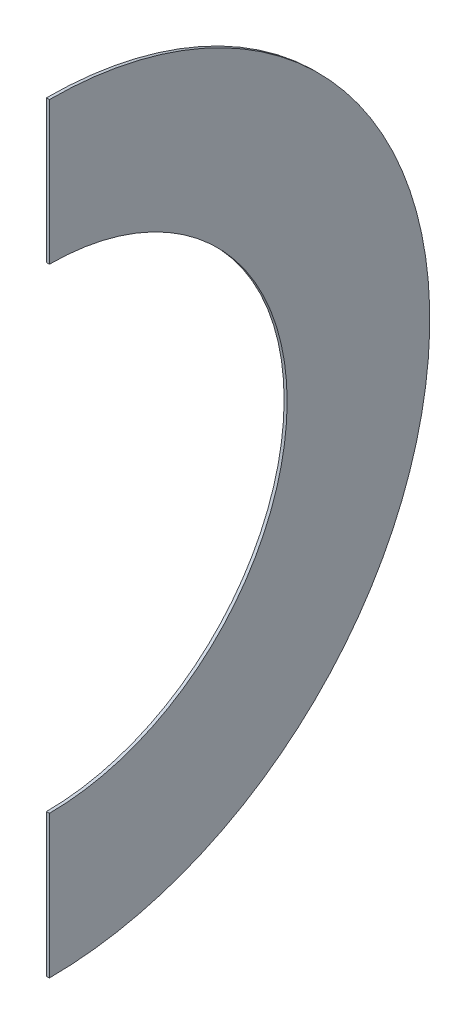
ISO-10303-21;
HEADER;
FILE_DESCRIPTION(('STEP AP214'),'2;1');
FILE_NAME('part.step','',(''),(''),'','','');
FILE_SCHEMA(('AUTOMOTIVE_DESIGN { 1 0 10303 214 1 1 1 1 }'));
ENDSEC;
DATA;
#1=APPLICATION_CONTEXT('core data for automotive mechanical design processes');
#2=APPLICATION_PROTOCOL_DEFINITION('international standard','automotive_design',2000,#1);
#3=PRODUCT_CONTEXT('',#1,'mechanical');
#4=PRODUCT('Part','Part','',(#3));
#5=PRODUCT_RELATED_PRODUCT_CATEGORY('part','',(#4));
#6=PRODUCT_DEFINITION_FORMATION('','',#4);
#7=PRODUCT_DEFINITION_CONTEXT('part definition',#1,'design');
#8=PRODUCT_DEFINITION('design','',#6,#7);
#9=PRODUCT_DEFINITION_SHAPE('','',#8);
#10=(LENGTH_UNIT() NAMED_UNIT(*) SI_UNIT(.MILLI.,.METRE.));
#11=(NAMED_UNIT(*) PLANE_ANGLE_UNIT() SI_UNIT($,.RADIAN.));
#12=(NAMED_UNIT(*) SI_UNIT($,.STERADIAN.) SOLID_ANGLE_UNIT());
#13=UNCERTAINTY_MEASURE_WITH_UNIT(LENGTH_MEASURE(1.E-05),#10,'distance_accuracy_value','');
#14=(GEOMETRIC_REPRESENTATION_CONTEXT(3) GLOBAL_UNCERTAINTY_ASSIGNED_CONTEXT((#13)) GLOBAL_UNIT_ASSIGNED_CONTEXT((#10,
#11,#12)) REPRESENTATION_CONTEXT('',''));
#15=CARTESIAN_POINT('',(0.,0.,0.));
#16=DIRECTION('',(0.,0.,1.));
#17=DIRECTION('',(1.,0.,0.));
#18=AXIS2_PLACEMENT_3D('',#15,#16,#17);
#19=CARTESIAN_POINT('',(1.5875,0.,0.));
#20=DIRECTION('',(-1.,0.,0.));
#21=DIRECTION('',(0.,0.,1.));
#22=AXIS2_PLACEMENT_3D('',#19,#20,#21);
#23=CYLINDRICAL_SURFACE('',#22,125.);
#24=CARTESIAN_POINT('',(0.,0.,0.));
#25=DIRECTION('',(1.,0.,0.));
#26=DIRECTION('',(0.,0.,-1.));
#27=AXIS2_PLACEMENT_3D('',#24,#25,#26);
#28=CIRCLE('',#27,125.);
#29=CARTESIAN_POINT('',(0.,-125.,0.));
#30=VERTEX_POINT('',#29);
#31=CARTESIAN_POINT('',(0.,125.,0.));
#32=VERTEX_POINT('',#31);
#33=EDGE_CURVE('E94',#30,#32,#28,.T.);
#34=ORIENTED_EDGE('',*,*,#33,.F.);
#35=DIRECTION('',(-1.,0.,0.));
#36=VECTOR('',#35,1.);
#37=CARTESIAN_POINT('',(1.5875,-125.,0.));
#38=LINE('',#37,#36);
#39=CARTESIAN_POINT('',(1.5875,-125.,0.));
#40=VERTEX_POINT('',#39);
#41=EDGE_CURVE('E11',#40,#30,#38,.T.);
#42=ORIENTED_EDGE('',*,*,#41,.F.);
#43=CARTESIAN_POINT('',(1.5875,0.,0.));
#44=DIRECTION('',(1.,0.,0.));
#45=DIRECTION('',(0.,0.,-1.));
#46=AXIS2_PLACEMENT_3D('',#43,#44,#45);
#47=CIRCLE('',#46,125.);
#48=CARTESIAN_POINT('',(1.5875,125.,0.));
#49=VERTEX_POINT('',#48);
#50=EDGE_CURVE('E83',#40,#49,#47,.T.);
#51=ORIENTED_EDGE('',*,*,#50,.T.);
#52=DIRECTION('',(-1.,0.,0.));
#53=VECTOR('',#52,1.);
#54=CARTESIAN_POINT('',(1.5875,125.,0.));
#55=LINE('',#54,#53);
#56=EDGE_CURVE('E72',#49,#32,#55,.T.);
#57=ORIENTED_EDGE('',*,*,#56,.T.);
#58=EDGE_LOOP('',(#34,#42,#51,#57));
#59=FACE_BOUND('',#58,.T.);
#60=ADVANCED_FACE('F33',(#59),#23,.F.);
#61=CARTESIAN_POINT('',(1.5875,0.,0.));
#62=DIRECTION('',(0.,0.,-1.));
#63=DIRECTION('',(-1.,0.,0.));
#64=AXIS2_PLACEMENT_3D('',#61,#62,#63);
#65=PLANE('',#64);
#66=DIRECTION('',(0.,-1.,0.));
#67=VECTOR('',#66,1.);
#68=CARTESIAN_POINT('',(0.,0.,0.));
#69=LINE('',#68,#67);
#70=CARTESIAN_POINT('',(0.,-200.,0.));
#71=VERTEX_POINT('',#70);
#72=EDGE_CURVE('E88',#30,#71,#69,.T.);
#73=ORIENTED_EDGE('',*,*,#72,.T.);
#74=DIRECTION('',(-1.,0.,0.));
#75=VECTOR('',#74,1.);
#76=CARTESIAN_POINT('',(1.5875,-200.,0.));
#77=LINE('',#76,#75);
#78=CARTESIAN_POINT('',(1.5875,-200.,0.));
#79=VERTEX_POINT('',#78);
#80=EDGE_CURVE('E41',#79,#71,#77,.T.);
#81=ORIENTED_EDGE('',*,*,#80,.F.);
#82=DIRECTION('',(0.,-1.,0.));
#83=VECTOR('',#82,1.);
#84=CARTESIAN_POINT('',(1.5875,0.,0.));
#85=LINE('',#84,#83);
#86=EDGE_CURVE('E78',#40,#79,#85,.T.);
#87=ORIENTED_EDGE('',*,*,#86,.F.);
#88=ORIENTED_EDGE('',*,*,#41,.T.);
#89=EDGE_LOOP('',(#73,#81,#87,#88));
#90=FACE_BOUND('',#89,.T.);
#91=ADVANCED_FACE('F86',(#90),#65,.F.);
#92=CARTESIAN_POINT('',(1.5875,0.,0.));
#93=DIRECTION('',(-1.,0.,0.));
#94=DIRECTION('',(0.,0.,1.));
#95=AXIS2_PLACEMENT_3D('',#92,#93,#94);
#96=CYLINDRICAL_SURFACE('',#95,200.);
#97=CARTESIAN_POINT('',(0.,0.,0.));
#98=DIRECTION('',(1.,0.,0.));
#99=DIRECTION('',(0.,0.,-1.));
#100=AXIS2_PLACEMENT_3D('',#97,#98,#99);
#101=CIRCLE('',#100,200.);
#102=CARTESIAN_POINT('',(0.,200.,0.));
#103=VERTEX_POINT('',#102);
#104=EDGE_CURVE('E65',#71,#103,#101,.T.);
#105=ORIENTED_EDGE('',*,*,#104,.T.);
#106=DIRECTION('',(-1.,0.,0.));
#107=VECTOR('',#106,1.);
#108=CARTESIAN_POINT('',(1.5875,200.,0.));
#109=LINE('',#108,#107);
#110=CARTESIAN_POINT('',(1.5875,200.,0.));
#111=VERTEX_POINT('',#110);
#112=EDGE_CURVE('E89',#111,#103,#109,.T.);
#113=ORIENTED_EDGE('',*,*,#112,.F.);
#114=CARTESIAN_POINT('',(1.5875,0.,0.));
#115=DIRECTION('',(1.,0.,0.));
#116=DIRECTION('',(0.,0.,-1.));
#117=AXIS2_PLACEMENT_3D('',#114,#115,#116);
#118=CIRCLE('',#117,200.);
#119=EDGE_CURVE('E82',#79,#111,#118,.T.);
#120=ORIENTED_EDGE('',*,*,#119,.F.);
#121=ORIENTED_EDGE('',*,*,#80,.T.);
#122=EDGE_LOOP('',(#105,#113,#120,#121));
#123=FACE_BOUND('',#122,.T.);
#124=ADVANCED_FACE('F90',(#123),#96,.T.);
#125=EDGE_CURVE('E98',#103,#32,#69,.T.);
#126=ORIENTED_EDGE('',*,*,#125,.T.);
#127=ORIENTED_EDGE('',*,*,#56,.F.);
#128=EDGE_CURVE('E49',#111,#49,#85,.T.);
#129=ORIENTED_EDGE('',*,*,#128,.F.);
#130=ORIENTED_EDGE('',*,*,#112,.T.);
#131=EDGE_LOOP('',(#126,#127,#129,#130));
#132=FACE_BOUND('',#131,.T.);
#133=ADVANCED_FACE('F103',(#132),#65,.F.);
#134=CARTESIAN_POINT('',(1.5875,0.,-440.141421356237));
#135=DIRECTION('',(1.,0.,0.));
#136=DIRECTION('',(0.,0.,-1.));
#137=AXIS2_PLACEMENT_3D('',#134,#135,#136);
#138=PLANE('',#137);
#139=ORIENTED_EDGE('',*,*,#50,.F.);
#140=ORIENTED_EDGE('',*,*,#86,.T.);
#141=ORIENTED_EDGE('',*,*,#119,.T.);
#142=ORIENTED_EDGE('',*,*,#128,.T.);
#143=EDGE_LOOP('',(#139,#140,#141,#142));
#144=FACE_BOUND('',#143,.T.);
#145=ADVANCED_FACE('F80',(#144),#138,.T.);
#146=CARTESIAN_POINT('',(0.,0.,-440.141421356237));
#147=DIRECTION('',(1.,0.,0.));
#148=DIRECTION('',(0.,0.,-1.));
#149=AXIS2_PLACEMENT_3D('',#146,#147,#148);
#150=PLANE('',#149);
#151=ORIENTED_EDGE('',*,*,#33,.T.);
#152=ORIENTED_EDGE('',*,*,#125,.F.);
#153=ORIENTED_EDGE('',*,*,#104,.F.);
#154=ORIENTED_EDGE('',*,*,#72,.F.);
#155=EDGE_LOOP('',(#151,#152,#153,#154));
#156=FACE_BOUND('',#155,.T.);
#157=ADVANCED_FACE('F105',(#156),#150,.F.);
#158=CLOSED_SHELL('',(#60,#91,#124,#133,#145,#157));
#159=MANIFOLD_SOLID_BREP('B2',#158);
#160=ADVANCED_BREP_SHAPE_REPRESENTATION('',(#18,#159),#14);
#161=SHAPE_DEFINITION_REPRESENTATION(#9,#160);
ENDSEC;
END-ISO-10303-21;
